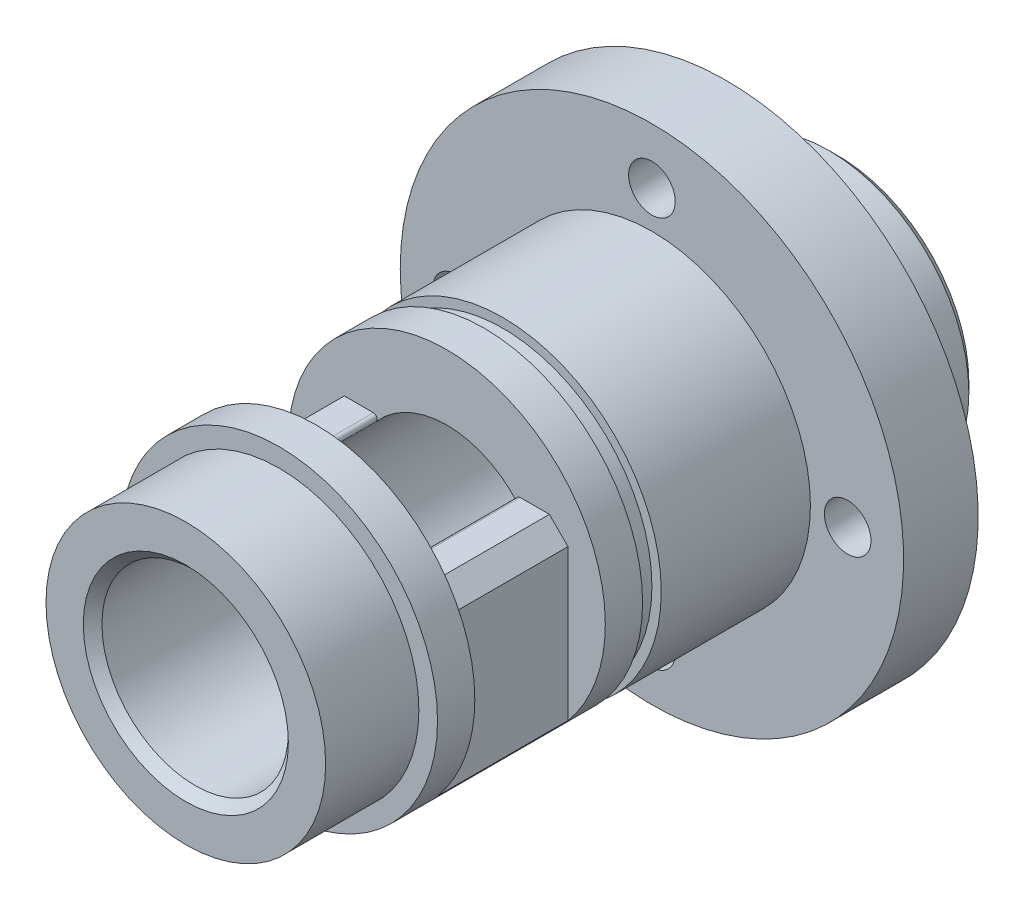
ISO-10303-21;
HEADER;
FILE_DESCRIPTION(('STEP AP214'),'2;1');
FILE_NAME('part.step','',(''),(''),'','','');
FILE_SCHEMA(('AUTOMOTIVE_DESIGN { 1 0 10303 214 1 1 1 1 }'));
ENDSEC;
DATA;
#1=APPLICATION_CONTEXT('core data for automotive mechanical design processes');
#2=APPLICATION_PROTOCOL_DEFINITION('international standard','automotive_design',2000,#1);
#3=PRODUCT_CONTEXT('',#1,'mechanical');
#4=PRODUCT('Part','Part','',(#3));
#5=PRODUCT_RELATED_PRODUCT_CATEGORY('part','',(#4));
#6=PRODUCT_DEFINITION_FORMATION('','',#4);
#7=PRODUCT_DEFINITION_CONTEXT('part definition',#1,'design');
#8=PRODUCT_DEFINITION('design','',#6,#7);
#9=PRODUCT_DEFINITION_SHAPE('','',#8);
#10=(LENGTH_UNIT() NAMED_UNIT(*) SI_UNIT(.MILLI.,.METRE.));
#11=(NAMED_UNIT(*) PLANE_ANGLE_UNIT() SI_UNIT($,.RADIAN.));
#12=(NAMED_UNIT(*) SI_UNIT($,.STERADIAN.) SOLID_ANGLE_UNIT());
#13=UNCERTAINTY_MEASURE_WITH_UNIT(LENGTH_MEASURE(1.E-05),#10,'distance_accuracy_value','');
#14=(GEOMETRIC_REPRESENTATION_CONTEXT(3) GLOBAL_UNCERTAINTY_ASSIGNED_CONTEXT((#13)) GLOBAL_UNIT_ASSIGNED_CONTEXT((#10,
#11,#12)) REPRESENTATION_CONTEXT('',''));
#15=CARTESIAN_POINT('',(0.,0.,0.));
#16=DIRECTION('',(0.,0.,1.));
#17=DIRECTION('',(1.,0.,0.));
#18=AXIS2_PLACEMENT_3D('',#15,#16,#17);
#19=CARTESIAN_POINT('',(0.,0.,20.));
#20=DIRECTION('',(0.,0.,-1.));
#21=DIRECTION('',(-1.,0.,0.));
#22=AXIS2_PLACEMENT_3D('',#19,#20,#21);
#23=CYLINDRICAL_SURFACE('',#22,8.5);
#24=CARTESIAN_POINT('',(0.,0.,11.));
#25=DIRECTION('',(0.,0.,1.));
#26=DIRECTION('',(1.,0.,0.));
#27=AXIS2_PLACEMENT_3D('',#24,#25,#26);
#28=CIRCLE('',#27,8.5);
#29=CARTESIAN_POINT('',(6.5,-5.47722557505166,11.));
#30=VERTEX_POINT('',#29);
#31=CARTESIAN_POINT('',(-6.5,-5.47722557505166,11.));
#32=VERTEX_POINT('',#31);
#33=EDGE_CURVE('E124',#30,#32,#28,.T.);
#34=ORIENTED_EDGE('',*,*,#33,.F.);
#35=DIRECTION('',(0.,0.,-1.));
#36=VECTOR('',#35,1.);
#37=CARTESIAN_POINT('',(6.5,-5.47722557505166,20.));
#38=LINE('',#37,#36);
#39=CARTESIAN_POINT('',(6.5,-5.47722557505166,18.));
#40=VERTEX_POINT('',#39);
#41=EDGE_CURVE('E127',#30,#40,#38,.F.);
#42=ORIENTED_EDGE('',*,*,#41,.T.);
#43=CARTESIAN_POINT('',(0.,0.,18.));
#44=DIRECTION('',(0.,0.,1.));
#45=DIRECTION('',(1.,0.,0.));
#46=AXIS2_PLACEMENT_3D('',#43,#44,#45);
#47=CIRCLE('',#46,8.5);
#48=CARTESIAN_POINT('',(-6.5,-5.47722557505167,18.));
#49=VERTEX_POINT('',#48);
#50=EDGE_CURVE('E177',#40,#49,#47,.T.);
#51=ORIENTED_EDGE('',*,*,#50,.T.);
#52=DIRECTION('',(0.,0.,-1.));
#53=VECTOR('',#52,1.);
#54=CARTESIAN_POINT('',(-6.5,-5.47722557505167,20.));
#55=LINE('',#54,#53);
#56=EDGE_CURVE('E129',#49,#32,#55,.T.);
#57=ORIENTED_EDGE('',*,*,#56,.T.);
#58=EDGE_LOOP('',(#34,#42,#51,#57));
#59=FACE_BOUND('',#58,.T.);
#60=CARTESIAN_POINT('',(0.,0.,9.));
#61=DIRECTION('',(0.,0.,1.));
#62=DIRECTION('',(1.,0.,0.));
#63=AXIS2_PLACEMENT_3D('',#60,#61,#62);
#64=CIRCLE('',#63,8.5);
#65=CARTESIAN_POINT('',(8.5,0.,9.));
#66=VERTEX_POINT('',#65);
#67=EDGE_CURVE('E209',#66,#66,#64,.T.);
#68=ORIENTED_EDGE('',*,*,#67,.T.);
#69=EDGE_LOOP('',(#68));
#70=FACE_BOUND('',#69,.T.);
#71=CARTESIAN_POINT('',(0.,0.,20.));
#72=DIRECTION('',(0.,0.,1.));
#73=DIRECTION('',(1.,0.,0.));
#74=AXIS2_PLACEMENT_3D('',#71,#72,#73);
#75=CIRCLE('',#74,8.5);
#76=CARTESIAN_POINT('',(8.5,0.,20.));
#77=VERTEX_POINT('',#76);
#78=EDGE_CURVE('E218',#77,#77,#75,.T.);
#79=ORIENTED_EDGE('',*,*,#78,.F.);
#80=EDGE_LOOP('',(#79));
#81=FACE_BOUND('',#80,.T.);
#82=CARTESIAN_POINT('',(0.,0.,11.));
#83=DIRECTION('',(0.,0.,1.));
#84=DIRECTION('',(1.,0.,0.));
#85=AXIS2_PLACEMENT_3D('',#82,#83,#84);
#86=CIRCLE('',#85,8.5);
#87=CARTESIAN_POINT('',(-6.02079728939615,-6.,11.));
#88=VERTEX_POINT('',#87);
#89=CARTESIAN_POINT('',(6.02079728939615,-6.,11.));
#90=VERTEX_POINT('',#89);
#91=EDGE_CURVE('E163',#88,#90,#86,.T.);
#92=ORIENTED_EDGE('',*,*,#91,.F.);
#93=DIRECTION('',(0.,0.,1.));
#94=VECTOR('',#93,1.);
#95=CARTESIAN_POINT('',(-6.02079728939615,-6.,11.));
#96=LINE('',#95,#94);
#97=CARTESIAN_POINT('',(-6.02079728939615,-6.,18.));
#98=VERTEX_POINT('',#97);
#99=EDGE_CURVE('E174',#88,#98,#96,.T.);
#100=ORIENTED_EDGE('',*,*,#99,.T.);
#101=CARTESIAN_POINT('',(0.,0.,18.));
#102=DIRECTION('',(0.,0.,1.));
#103=DIRECTION('',(1.,0.,0.));
#104=AXIS2_PLACEMENT_3D('',#101,#102,#103);
#105=CIRCLE('',#104,8.5);
#106=CARTESIAN_POINT('',(6.02079728939615,-6.,18.));
#107=VERTEX_POINT('',#106);
#108=EDGE_CURVE('E162',#98,#107,#105,.T.);
#109=ORIENTED_EDGE('',*,*,#108,.T.);
#110=DIRECTION('',(0.,0.,1.));
#111=VECTOR('',#110,1.);
#112=CARTESIAN_POINT('',(6.02079728939615,-6.,11.));
#113=LINE('',#112,#111);
#114=EDGE_CURVE('E169',#90,#107,#113,.T.);
#115=ORIENTED_EDGE('',*,*,#114,.F.);
#116=EDGE_LOOP('',(#92,#100,#109,#115));
#117=FACE_BOUND('',#116,.T.);
#118=ADVANCED_FACE('F36',(#59,#70,#81,#117),#23,.T.);
#119=CARTESIAN_POINT('',(0.,0.,25.));
#120=DIRECTION('',(0.,0.,-1.));
#121=DIRECTION('',(-1.,0.,0.));
#122=AXIS2_PLACEMENT_3D('',#119,#120,#121);
#123=CYLINDRICAL_SURFACE('',#122,5.);
#124=CARTESIAN_POINT('',(0.,0.,24.5));
#125=DIRECTION('',(0.,0.,1.));
#126=DIRECTION('',(1.,0.,0.));
#127=AXIS2_PLACEMENT_3D('',#124,#125,#126);
#128=CIRCLE('',#127,5.);
#129=CARTESIAN_POINT('',(5.,0.,24.5));
#130=VERTEX_POINT('',#129);
#131=EDGE_CURVE('E236',#130,#130,#128,.T.);
#132=ORIENTED_EDGE('',*,*,#131,.T.);
#133=EDGE_LOOP('',(#132));
#134=FACE_BOUND('',#133,.T.);
#135=CARTESIAN_POINT('',(0.,0.,-10.));
#136=DIRECTION('',(0.,0.,-1.));
#137=DIRECTION('',(-1.,0.,0.));
#138=AXIS2_PLACEMENT_3D('',#135,#136,#137);
#139=CIRCLE('',#138,5.);
#140=CARTESIAN_POINT('',(-5.,0.,-10.));
#141=VERTEX_POINT('',#140);
#142=EDGE_CURVE('E183',#141,#141,#139,.T.);
#143=ORIENTED_EDGE('',*,*,#142,.T.);
#144=EDGE_LOOP('',(#143));
#145=FACE_BOUND('',#144,.T.);
#146=DIRECTION('',(0.,0.,-1.));
#147=VECTOR('',#146,1.);
#148=CARTESIAN_POINT('',(-3.78313761017423,3.26923076923077,25.));
#149=LINE('',#148,#147);
#150=CARTESIAN_POINT('',(-3.78313761017423,3.26923076923077,11.));
#151=VERTEX_POINT('',#150);
#152=CARTESIAN_POINT('',(-3.78313761017423,3.26923076923077,18.));
#153=VERTEX_POINT('',#152);
#154=EDGE_CURVE('E260',#151,#153,#149,.F.);
#155=ORIENTED_EDGE('',*,*,#154,.T.);
#156=CARTESIAN_POINT('',(0.,0.,18.));
#157=DIRECTION('',(0.,0.,1.));
#158=DIRECTION('',(1.,0.,0.));
#159=AXIS2_PLACEMENT_3D('',#156,#157,#158);
#160=CIRCLE('',#159,5.);
#161=CARTESIAN_POINT('',(3.78313761017423,3.26923076923077,18.));
#162=VERTEX_POINT('',#161);
#163=EDGE_CURVE('E229',#153,#162,#160,.F.);
#164=ORIENTED_EDGE('',*,*,#163,.T.);
#165=DIRECTION('',(0.,0.,-1.));
#166=VECTOR('',#165,1.);
#167=CARTESIAN_POINT('',(3.78313761017423,3.26923076923077,25.));
#168=LINE('',#167,#166);
#169=CARTESIAN_POINT('',(3.78313761017423,3.26923076923077,11.));
#170=VERTEX_POINT('',#169);
#171=EDGE_CURVE('E257',#162,#170,#168,.T.);
#172=ORIENTED_EDGE('',*,*,#171,.T.);
#173=CARTESIAN_POINT('',(0.,0.,11.));
#174=DIRECTION('',(0.,0.,1.));
#175=DIRECTION('',(1.,0.,0.));
#176=AXIS2_PLACEMENT_3D('',#173,#174,#175);
#177=CIRCLE('',#176,5.);
#178=EDGE_CURVE('E231',#151,#170,#177,.F.);
#179=ORIENTED_EDGE('',*,*,#178,.F.);
#180=EDGE_LOOP('',(#155,#164,#172,#179));
#181=FACE_BOUND('',#180,.T.);
#182=ADVANCED_FACE('F278',(#134,#145,#181),#123,.F.);
#183=CARTESIAN_POINT('',(0.,0.,20.));
#184=DIRECTION('',(0.,0.,1.));
#185=DIRECTION('',(1.,0.,0.));
#186=AXIS2_PLACEMENT_3D('',#183,#184,#185);
#187=PLANE('',#186);
#188=CARTESIAN_POINT('',(0.,0.,20.));
#189=DIRECTION('',(0.,0.,1.));
#190=DIRECTION('',(1.,0.,0.));
#191=AXIS2_PLACEMENT_3D('',#188,#189,#190);
#192=CIRCLE('',#191,7.5);
#193=CARTESIAN_POINT('',(7.5,0.,20.));
#194=VERTEX_POINT('',#193);
#195=EDGE_CURVE('E212',#194,#194,#192,.T.);
#196=ORIENTED_EDGE('',*,*,#195,.F.);
#197=EDGE_LOOP('',(#196));
#198=FACE_BOUND('',#197,.T.);
#199=ORIENTED_EDGE('',*,*,#78,.T.);
#200=EDGE_LOOP('',(#199));
#201=FACE_BOUND('',#200,.T.);
#202=ADVANCED_FACE('F313',(#198,#201),#187,.T.);
#203=CARTESIAN_POINT('',(0.,0.,25.));
#204=DIRECTION('',(0.,0.,-1.));
#205=DIRECTION('',(-1.,0.,0.));
#206=AXIS2_PLACEMENT_3D('',#203,#204,#205);
#207=CYLINDRICAL_SURFACE('',#206,7.5);
#208=CARTESIAN_POINT('',(0.,0.,25.));
#209=DIRECTION('',(0.,0.,1.));
#210=DIRECTION('',(1.,0.,0.));
#211=AXIS2_PLACEMENT_3D('',#208,#209,#210);
#212=CIRCLE('',#211,7.5);
#213=CARTESIAN_POINT('',(7.5,0.,25.));
#214=VERTEX_POINT('',#213);
#215=EDGE_CURVE('E215',#214,#214,#212,.T.);
#216=ORIENTED_EDGE('',*,*,#215,.F.);
#217=EDGE_LOOP('',(#216));
#218=FACE_BOUND('',#217,.T.);
#219=ORIENTED_EDGE('',*,*,#195,.T.);
#220=EDGE_LOOP('',(#219));
#221=FACE_BOUND('',#220,.T.);
#222=ADVANCED_FACE('F351',(#218,#221),#207,.T.);
#223=CARTESIAN_POINT('',(0.,0.,25.));
#224=DIRECTION('',(0.,0.,1.));
#225=DIRECTION('',(1.,0.,0.));
#226=AXIS2_PLACEMENT_3D('',#223,#224,#225);
#227=PLANE('',#226);
#228=CARTESIAN_POINT('',(0.,0.,25.));
#229=DIRECTION('',(0.,0.,1.));
#230=DIRECTION('',(1.,0.,0.));
#231=AXIS2_PLACEMENT_3D('',#228,#229,#230);
#232=CIRCLE('',#231,5.50000000000001);
#233=CARTESIAN_POINT('',(5.50000000000001,0.,25.));
#234=VERTEX_POINT('',#233);
#235=EDGE_CURVE('E233',#234,#234,#232,.F.);
#236=ORIENTED_EDGE('',*,*,#235,.T.);
#237=EDGE_LOOP('',(#236));
#238=FACE_BOUND('',#237,.T.);
#239=ORIENTED_EDGE('',*,*,#215,.T.);
#240=EDGE_LOOP('',(#239));
#241=FACE_BOUND('',#240,.T.);
#242=ADVANCED_FACE('F345',(#238,#241),#227,.T.);
#243=CARTESIAN_POINT('',(0.,0.,9.));
#244=DIRECTION('',(0.,0.,1.));
#245=DIRECTION('',(1.,0.,0.));
#246=AXIS2_PLACEMENT_3D('',#243,#244,#245);
#247=PLANE('',#246);
#248=ORIENTED_EDGE('',*,*,#67,.F.);
#249=EDGE_LOOP('',(#248));
#250=FACE_BOUND('',#249,.T.);
#251=CARTESIAN_POINT('',(0.,0.,9.));
#252=DIRECTION('',(0.,0.,1.));
#253=DIRECTION('',(1.,0.,0.));
#254=AXIS2_PLACEMENT_3D('',#251,#252,#253);
#255=CIRCLE('',#254,8.);
#256=CARTESIAN_POINT('',(8.,0.,9.));
#257=VERTEX_POINT('',#256);
#258=EDGE_CURVE('E203',#257,#257,#255,.T.);
#259=ORIENTED_EDGE('',*,*,#258,.T.);
#260=EDGE_LOOP('',(#259));
#261=FACE_BOUND('',#260,.T.);
#262=ADVANCED_FACE('F338',(#250,#261),#247,.F.);
#263=CARTESIAN_POINT('',(0.,0.,8.));
#264=DIRECTION('',(0.,0.,1.));
#265=DIRECTION('',(1.,0.,0.));
#266=AXIS2_PLACEMENT_3D('',#263,#264,#265);
#267=PLANE('',#266);
#268=CARTESIAN_POINT('',(0.,0.,8.));
#269=DIRECTION('',(0.,0.,1.));
#270=DIRECTION('',(1.,0.,0.));
#271=AXIS2_PLACEMENT_3D('',#268,#269,#270);
#272=CIRCLE('',#271,8.5);
#273=CARTESIAN_POINT('',(8.5,0.,8.));
#274=VERTEX_POINT('',#273);
#275=EDGE_CURVE('E206',#274,#274,#272,.T.);
#276=ORIENTED_EDGE('',*,*,#275,.T.);
#277=EDGE_LOOP('',(#276));
#278=FACE_BOUND('',#277,.T.);
#279=CARTESIAN_POINT('',(0.,0.,8.));
#280=DIRECTION('',(0.,0.,1.));
#281=DIRECTION('',(1.,0.,0.));
#282=AXIS2_PLACEMENT_3D('',#279,#280,#281);
#283=CIRCLE('',#282,8.);
#284=CARTESIAN_POINT('',(8.,0.,8.));
#285=VERTEX_POINT('',#284);
#286=EDGE_CURVE('E202',#285,#285,#283,.T.);
#287=ORIENTED_EDGE('',*,*,#286,.F.);
#288=EDGE_LOOP('',(#287));
#289=FACE_BOUND('',#288,.T.);
#290=ADVANCED_FACE('F329',(#278,#289),#267,.T.);
#291=CARTESIAN_POINT('',(0.,0.,9.));
#292=DIRECTION('',(0.,0.,-1.));
#293=DIRECTION('',(-1.,0.,0.));
#294=AXIS2_PLACEMENT_3D('',#291,#292,#293);
#295=CYLINDRICAL_SURFACE('',#294,8.);
#296=ORIENTED_EDGE('',*,*,#258,.F.);
#297=EDGE_LOOP('',(#296));
#298=FACE_BOUND('',#297,.T.);
#299=ORIENTED_EDGE('',*,*,#286,.T.);
#300=EDGE_LOOP('',(#299));
#301=FACE_BOUND('',#300,.T.);
#302=ADVANCED_FACE('F320',(#298,#301),#295,.T.);
#303=CARTESIAN_POINT('',(0.,0.,0.));
#304=DIRECTION('',(0.,0.,-1.));
#305=DIRECTION('',(-1.,0.,0.));
#306=AXIS2_PLACEMENT_3D('',#303,#304,#305);
#307=CIRCLE('',#306,8.5);
#308=CARTESIAN_POINT('',(-8.5,0.,0.));
#309=VERTEX_POINT('',#308);
#310=EDGE_CURVE('E197',#309,#309,#307,.T.);
#311=ORIENTED_EDGE('',*,*,#310,.F.);
#312=EDGE_LOOP('',(#311));
#313=FACE_BOUND('',#312,.T.);
#314=ORIENTED_EDGE('',*,*,#275,.F.);
#315=EDGE_LOOP('',(#314));
#316=FACE_BOUND('',#315,.T.);
#317=ADVANCED_FACE('F309',(#313,#316),#23,.T.);
#318=CARTESIAN_POINT('',(0.,0.,-4.));
#319=DIRECTION('',(0.,0.,1.));
#320=DIRECTION('',(1.,0.,0.));
#321=AXIS2_PLACEMENT_3D('',#318,#319,#320);
#322=CYLINDRICAL_SURFACE('',#321,13.5);
#323=CARTESIAN_POINT('',(0.,0.,-4.));
#324=DIRECTION('',(0.,0.,-1.));
#325=DIRECTION('',(-1.,0.,0.));
#326=AXIS2_PLACEMENT_3D('',#323,#324,#325);
#327=CIRCLE('',#326,13.5);
#328=CARTESIAN_POINT('',(-13.5,0.,-4.));
#329=VERTEX_POINT('',#328);
#330=EDGE_CURVE('E194',#329,#329,#327,.T.);
#331=ORIENTED_EDGE('',*,*,#330,.F.);
#332=EDGE_LOOP('',(#331));
#333=FACE_BOUND('',#332,.T.);
#334=CARTESIAN_POINT('',(0.,0.,0.));
#335=DIRECTION('',(0.,0.,-1.));
#336=DIRECTION('',(-1.,0.,0.));
#337=AXIS2_PLACEMENT_3D('',#334,#335,#336);
#338=CIRCLE('',#337,13.5);
#339=CARTESIAN_POINT('',(-13.5,0.,0.));
#340=VERTEX_POINT('',#339);
#341=EDGE_CURVE('E193',#340,#340,#338,.T.);
#342=ORIENTED_EDGE('',*,*,#341,.T.);
#343=EDGE_LOOP('',(#342));
#344=FACE_BOUND('',#343,.T.);
#345=ADVANCED_FACE('F319',(#333,#344),#322,.T.);
#346=CARTESIAN_POINT('',(0.,0.,-4.));
#347=DIRECTION('',(0.,0.,-1.));
#348=DIRECTION('',(-1.,0.,0.));
#349=AXIS2_PLACEMENT_3D('',#346,#347,#348);
#350=PLANE('',#349);
#351=CARTESIAN_POINT('',(10.5,0.,-4.));
#352=DIRECTION('',(0.,0.,-1.));
#353=DIRECTION('',(-1.,0.,0.));
#354=AXIS2_PLACEMENT_3D('',#351,#352,#353);
#355=CIRCLE('',#354,1.24999999999999);
#356=CARTESIAN_POINT('',(9.25000000000001,0.,-4.));
#357=VERTEX_POINT('',#356);
#358=EDGE_CURVE('E444',#357,#357,#355,.T.);
#359=ORIENTED_EDGE('',*,*,#358,.F.);
#360=EDGE_LOOP('',(#359));
#361=FACE_BOUND('',#360,.T.);
#362=CARTESIAN_POINT('',(0.,10.5,-4.));
#363=DIRECTION('',(0.,0.,-1.));
#364=DIRECTION('',(-1.,0.,0.));
#365=AXIS2_PLACEMENT_3D('',#362,#363,#364);
#366=CIRCLE('',#365,1.24999999999999);
#367=CARTESIAN_POINT('',(-1.24999999999999,10.5,-4.));
#368=VERTEX_POINT('',#367);
#369=EDGE_CURVE('E440',#368,#368,#366,.T.);
#370=ORIENTED_EDGE('',*,*,#369,.F.);
#371=EDGE_LOOP('',(#370));
#372=FACE_BOUND('',#371,.T.);
#373=CARTESIAN_POINT('',(-10.5,0.,-4.));
#374=DIRECTION('',(0.,0.,-1.));
#375=DIRECTION('',(-1.,0.,0.));
#376=AXIS2_PLACEMENT_3D('',#373,#374,#375);
#377=CIRCLE('',#376,1.24999999999999);
#378=CARTESIAN_POINT('',(-11.75,0.,-4.));
#379=VERTEX_POINT('',#378);
#380=EDGE_CURVE('E434',#379,#379,#377,.T.);
#381=ORIENTED_EDGE('',*,*,#380,.F.);
#382=EDGE_LOOP('',(#381));
#383=FACE_BOUND('',#382,.T.);
#384=CARTESIAN_POINT('',(0.,-10.5,-4.));
#385=DIRECTION('',(0.,0.,-1.));
#386=DIRECTION('',(-1.,0.,0.));
#387=AXIS2_PLACEMENT_3D('',#384,#385,#386);
#388=CIRCLE('',#387,1.24999999999999);
#389=CARTESIAN_POINT('',(-1.24999999999999,-10.5,-4.));
#390=VERTEX_POINT('',#389);
#391=EDGE_CURVE('E154',#390,#390,#388,.T.);
#392=ORIENTED_EDGE('',*,*,#391,.F.);
#393=EDGE_LOOP('',(#392));
#394=FACE_BOUND('',#393,.T.);
#395=CARTESIAN_POINT('',(0.,0.,-4.));
#396=DIRECTION('',(0.,0.,-1.));
#397=DIRECTION('',(-1.,0.,0.));
#398=AXIS2_PLACEMENT_3D('',#395,#396,#397);
#399=CIRCLE('',#398,7.5);
#400=CARTESIAN_POINT('',(-7.5,0.,-4.));
#401=VERTEX_POINT('',#400);
#402=EDGE_CURVE('E190',#401,#401,#399,.T.);
#403=ORIENTED_EDGE('',*,*,#402,.F.);
#404=EDGE_LOOP('',(#403));
#405=FACE_BOUND('',#404,.T.);
#406=ORIENTED_EDGE('',*,*,#330,.T.);
#407=EDGE_LOOP('',(#406));
#408=FACE_BOUND('',#407,.T.);
#409=ADVANCED_FACE('F326',(#361,#372,#383,#394,#405,#408),#350,.T.);
#410=CARTESIAN_POINT('',(0.,0.,0.));
#411=DIRECTION('',(0.,0.,-1.));
#412=DIRECTION('',(-1.,0.,0.));
#413=AXIS2_PLACEMENT_3D('',#410,#411,#412);
#414=PLANE('',#413);
#415=CARTESIAN_POINT('',(10.5,0.,0.));
#416=DIRECTION('',(0.,0.,-1.));
#417=DIRECTION('',(-1.,0.,0.));
#418=AXIS2_PLACEMENT_3D('',#415,#416,#417);
#419=CIRCLE('',#418,1.24999999999999);
#420=CARTESIAN_POINT('',(9.25000000000001,0.,0.));
#421=VERTEX_POINT('',#420);
#422=EDGE_CURVE('E410',#421,#421,#419,.T.);
#423=ORIENTED_EDGE('',*,*,#422,.T.);
#424=EDGE_LOOP('',(#423));
#425=FACE_BOUND('',#424,.T.);
#426=CARTESIAN_POINT('',(0.,10.5,0.));
#427=DIRECTION('',(0.,0.,-1.));
#428=DIRECTION('',(-1.,0.,0.));
#429=AXIS2_PLACEMENT_3D('',#426,#427,#428);
#430=CIRCLE('',#429,1.24999999999999);
#431=CARTESIAN_POINT('',(-1.24999999999999,10.5,0.));
#432=VERTEX_POINT('',#431);
#433=EDGE_CURVE('E414',#432,#432,#430,.T.);
#434=ORIENTED_EDGE('',*,*,#433,.T.);
#435=EDGE_LOOP('',(#434));
#436=FACE_BOUND('',#435,.T.);
#437=CARTESIAN_POINT('',(-10.5,0.,0.));
#438=DIRECTION('',(0.,0.,-1.));
#439=DIRECTION('',(-1.,0.,0.));
#440=AXIS2_PLACEMENT_3D('',#437,#438,#439);
#441=CIRCLE('',#440,1.24999999999999);
#442=CARTESIAN_POINT('',(-11.75,0.,0.));
#443=VERTEX_POINT('',#442);
#444=EDGE_CURVE('E418',#443,#443,#441,.T.);
#445=ORIENTED_EDGE('',*,*,#444,.T.);
#446=EDGE_LOOP('',(#445));
#447=FACE_BOUND('',#446,.T.);
#448=CARTESIAN_POINT('',(0.,-10.5,0.));
#449=DIRECTION('',(0.,0.,-1.));
#450=DIRECTION('',(-1.,0.,0.));
#451=AXIS2_PLACEMENT_3D('',#448,#449,#450);
#452=CIRCLE('',#451,1.24999999999999);
#453=CARTESIAN_POINT('',(-1.24999999999999,-10.5,0.));
#454=VERTEX_POINT('',#453);
#455=EDGE_CURVE('E150',#454,#454,#452,.T.);
#456=ORIENTED_EDGE('',*,*,#455,.T.);
#457=EDGE_LOOP('',(#456));
#458=FACE_BOUND('',#457,.T.);
#459=ORIENTED_EDGE('',*,*,#310,.T.);
#460=EDGE_LOOP('',(#459));
#461=FACE_BOUND('',#460,.T.);
#462=ORIENTED_EDGE('',*,*,#341,.F.);
#463=EDGE_LOOP('',(#462));
#464=FACE_BOUND('',#463,.T.);
#465=ADVANCED_FACE('F398',(#425,#436,#447,#458,#461,#464),#414,.F.);
#466=CARTESIAN_POINT('',(0.,0.,-10.));
#467=DIRECTION('',(0.,0.,1.));
#468=DIRECTION('',(1.,0.,0.));
#469=AXIS2_PLACEMENT_3D('',#466,#467,#468);
#470=CYLINDRICAL_SURFACE('',#469,7.5);
#471=CARTESIAN_POINT('',(0.,0.,-9.50000000000001));
#472=DIRECTION('',(0.,0.,-1.));
#473=DIRECTION('',(-1.,0.,0.));
#474=AXIS2_PLACEMENT_3D('',#471,#472,#473);
#475=CIRCLE('',#474,7.5);
#476=CARTESIAN_POINT('',(-7.5,0.,-9.50000000000001));
#477=VERTEX_POINT('',#476);
#478=EDGE_CURVE('E226',#477,#477,#475,.F.);
#479=ORIENTED_EDGE('',*,*,#478,.T.);
#480=EDGE_LOOP('',(#479));
#481=FACE_BOUND('',#480,.T.);
#482=ORIENTED_EDGE('',*,*,#402,.T.);
#483=EDGE_LOOP('',(#482));
#484=FACE_BOUND('',#483,.T.);
#485=ADVANCED_FACE('F394',(#481,#484),#470,.T.);
#486=CARTESIAN_POINT('',(0.,0.,-10.));
#487=DIRECTION('',(0.,0.,-1.));
#488=DIRECTION('',(-1.,0.,0.));
#489=AXIS2_PLACEMENT_3D('',#486,#487,#488);
#490=PLANE('',#489);
#491=CARTESIAN_POINT('',(0.,0.,-10.));
#492=DIRECTION('',(0.,0.,-1.));
#493=DIRECTION('',(-1.,0.,0.));
#494=AXIS2_PLACEMENT_3D('',#491,#492,#493);
#495=CIRCLE('',#494,7.00000000000001);
#496=CARTESIAN_POINT('',(-7.00000000000001,0.,-10.));
#497=VERTEX_POINT('',#496);
#498=EDGE_CURVE('E223',#497,#497,#495,.T.);
#499=ORIENTED_EDGE('',*,*,#498,.T.);
#500=EDGE_LOOP('',(#499));
#501=FACE_BOUND('',#500,.T.);
#502=ORIENTED_EDGE('',*,*,#142,.F.);
#503=EDGE_LOOP('',(#502));
#504=FACE_BOUND('',#503,.T.);
#505=ADVANCED_FACE('F391',(#501,#504),#490,.T.);
#506=CARTESIAN_POINT('',(0.,0.,-10.));
#507=DIRECTION('',(0.,0.,1.));
#508=DIRECTION('',(1.,0.,0.));
#509=AXIS2_PLACEMENT_3D('',#506,#507,#508);
#510=CONICAL_SURFACE('',#509,7.00000000000001,0.785398163397444);
#511=ORIENTED_EDGE('',*,*,#478,.F.);
#512=EDGE_LOOP('',(#511));
#513=FACE_BOUND('',#512,.T.);
#514=ORIENTED_EDGE('',*,*,#498,.F.);
#515=EDGE_LOOP('',(#514));
#516=FACE_BOUND('',#515,.T.);
#517=ADVANCED_FACE('F389',(#513,#516),#510,.T.);
#518=CARTESIAN_POINT('',(-7.7,3.6,11.));
#519=DIRECTION('',(0.,-1.,0.));
#520=DIRECTION('',(0.,0.,-1.));
#521=AXIS2_PLACEMENT_3D('',#518,#519,#520);
#522=PLANE('',#521);
#523=DIRECTION('',(1.,0.,0.));
#524=VECTOR('',#523,1.);
#525=CARTESIAN_POINT('',(-7.7,3.6,18.));
#526=LINE('',#525,#524);
#527=CARTESIAN_POINT('',(-5.5,3.6,18.));
#528=VERTEX_POINT('',#527);
#529=CARTESIAN_POINT('',(-3.9344631145812,3.6,18.));
#530=VERTEX_POINT('',#529);
#531=EDGE_CURVE('E134',#528,#530,#526,.T.);
#532=ORIENTED_EDGE('',*,*,#531,.T.);
#533=DIRECTION('',(0.,0.,-1.));
#534=VECTOR('',#533,1.);
#535=CARTESIAN_POINT('',(-3.9344631145812,3.6,11.));
#536=LINE('',#535,#534);
#537=CARTESIAN_POINT('',(-3.9344631145812,3.6,11.));
#538=VERTEX_POINT('',#537);
#539=EDGE_CURVE('E263',#530,#538,#536,.T.);
#540=ORIENTED_EDGE('',*,*,#539,.T.);
#541=DIRECTION('',(1.,0.,0.));
#542=VECTOR('',#541,1.);
#543=CARTESIAN_POINT('',(-7.7,3.6,11.));
#544=LINE('',#543,#542);
#545=CARTESIAN_POINT('',(-5.5,3.6,11.));
#546=VERTEX_POINT('',#545);
#547=EDGE_CURVE('E180',#546,#538,#544,.T.);
#548=ORIENTED_EDGE('',*,*,#547,.F.);
#549=DIRECTION('',(0.,0.,1.));
#550=VECTOR('',#549,1.);
#551=CARTESIAN_POINT('',(-5.5,3.6,11.));
#552=LINE('',#551,#550);
#553=EDGE_CURVE('E247',#546,#528,#552,.T.);
#554=ORIENTED_EDGE('',*,*,#553,.T.);
#555=EDGE_LOOP('',(#532,#540,#548,#554));
#556=FACE_BOUND('',#555,.T.);
#557=ADVANCED_FACE('F296',(#556),#522,.F.);
#558=CARTESIAN_POINT('',(3.9344631145812,3.6,11.));
#559=VERTEX_POINT('',#558);
#560=CARTESIAN_POINT('',(5.5,3.6,11.));
#561=VERTEX_POINT('',#560);
#562=EDGE_CURVE('E133',#559,#561,#544,.T.);
#563=ORIENTED_EDGE('',*,*,#562,.F.);
#564=DIRECTION('',(0.,0.,-1.));
#565=VECTOR('',#564,1.);
#566=CARTESIAN_POINT('',(3.9344631145812,3.6,11.));
#567=LINE('',#566,#565);
#568=CARTESIAN_POINT('',(3.9344631145812,3.6,18.));
#569=VERTEX_POINT('',#568);
#570=EDGE_CURVE('E57',#559,#569,#567,.F.);
#571=ORIENTED_EDGE('',*,*,#570,.T.);
#572=CARTESIAN_POINT('',(5.5,3.6,18.));
#573=VERTEX_POINT('',#572);
#574=EDGE_CURVE('E185',#569,#573,#526,.T.);
#575=ORIENTED_EDGE('',*,*,#574,.T.);
#576=DIRECTION('',(0.,0.,-1.));
#577=VECTOR('',#576,1.);
#578=CARTESIAN_POINT('',(5.5,3.6,11.));
#579=LINE('',#578,#577);
#580=EDGE_CURVE('E241',#573,#561,#579,.T.);
#581=ORIENTED_EDGE('',*,*,#580,.T.);
#582=EDGE_LOOP('',(#563,#571,#575,#581));
#583=FACE_BOUND('',#582,.T.);
#584=ADVANCED_FACE('F286',(#583),#522,.F.);
#585=CARTESIAN_POINT('',(0.,0.,11.));
#586=DIRECTION('',(0.,0.,1.));
#587=DIRECTION('',(1.,0.,0.));
#588=AXIS2_PLACEMENT_3D('',#585,#586,#587);
#589=PLANE('',#588);
#590=ORIENTED_EDGE('',*,*,#178,.T.);
#591=CARTESIAN_POINT('',(3.9344631145812,3.4,11.));
#592=DIRECTION('',(0.,0.,1.));
#593=DIRECTION('',(1.,0.,0.));
#594=AXIS2_PLACEMENT_3D('',#591,#592,#593);
#595=CIRCLE('',#594,0.2);
#596=EDGE_CURVE('E44',#170,#559,#595,.F.);
#597=ORIENTED_EDGE('',*,*,#596,.T.);
#598=ORIENTED_EDGE('',*,*,#562,.T.);
#599=DIRECTION('',(-0.707106781186549,0.707106781186546,0.));
#600=VECTOR('',#599,1.);
#601=CARTESIAN_POINT('',(6.5,2.6,11.));
#602=LINE('',#601,#600);
#603=CARTESIAN_POINT('',(6.5,2.6,11.));
#604=VERTEX_POINT('',#603);
#605=EDGE_CURVE('E149',#561,#604,#602,.F.);
#606=ORIENTED_EDGE('',*,*,#605,.T.);
#607=DIRECTION('',(0.,1.,0.));
#608=VECTOR('',#607,1.);
#609=CARTESIAN_POINT('',(6.5,-13.5,11.));
#610=LINE('',#609,#608);
#611=EDGE_CURVE('E141',#30,#604,#610,.T.);
#612=ORIENTED_EDGE('',*,*,#611,.F.);
#613=ORIENTED_EDGE('',*,*,#33,.T.);
#614=DIRECTION('',(0.,1.,0.));
#615=VECTOR('',#614,1.);
#616=CARTESIAN_POINT('',(-6.5,-13.5,11.));
#617=LINE('',#616,#615);
#618=CARTESIAN_POINT('',(-6.5,2.6,11.));
#619=VERTEX_POINT('',#618);
#620=EDGE_CURVE('E145',#32,#619,#617,.T.);
#621=ORIENTED_EDGE('',*,*,#620,.T.);
#622=DIRECTION('',(-0.70710678118655,-0.707106781186545,0.));
#623=VECTOR('',#622,1.);
#624=CARTESIAN_POINT('',(-6.5,2.6,11.));
#625=LINE('',#624,#623);
#626=EDGE_CURVE('E253',#619,#546,#625,.F.);
#627=ORIENTED_EDGE('',*,*,#626,.T.);
#628=ORIENTED_EDGE('',*,*,#547,.T.);
#629=CARTESIAN_POINT('',(-3.9344631145812,3.4,11.));
#630=DIRECTION('',(0.,0.,1.));
#631=DIRECTION('',(1.,0.,0.));
#632=AXIS2_PLACEMENT_3D('',#629,#630,#631);
#633=CIRCLE('',#632,0.2);
#634=EDGE_CURVE('E268',#538,#151,#633,.F.);
#635=ORIENTED_EDGE('',*,*,#634,.T.);
#636=EDGE_LOOP('',(#590,#597,#598,#606,#612,#613,#621,#627,#628,#635));
#637=FACE_BOUND('',#636,.T.);
#638=ADVANCED_FACE('F147',(#637),#589,.T.);
#639=CARTESIAN_POINT('',(0.,0.,18.));
#640=DIRECTION('',(0.,0.,1.));
#641=DIRECTION('',(1.,0.,0.));
#642=AXIS2_PLACEMENT_3D('',#639,#640,#641);
#643=PLANE('',#642);
#644=ORIENTED_EDGE('',*,*,#531,.F.);
#645=DIRECTION('',(0.70710678118655,0.707106781186545,0.));
#646=VECTOR('',#645,1.);
#647=CARTESIAN_POINT('',(-4.54999999999998,4.55000000000001,18.));
#648=LINE('',#647,#646);
#649=CARTESIAN_POINT('',(-6.5,2.6,18.));
#650=VERTEX_POINT('',#649);
#651=EDGE_CURVE('E255',#528,#650,#648,.F.);
#652=ORIENTED_EDGE('',*,*,#651,.T.);
#653=DIRECTION('',(0.,1.,0.));
#654=VECTOR('',#653,1.);
#655=CARTESIAN_POINT('',(-6.5,-13.5,18.));
#656=LINE('',#655,#654);
#657=EDGE_CURVE('E157',#49,#650,#656,.T.);
#658=ORIENTED_EDGE('',*,*,#657,.F.);
#659=ORIENTED_EDGE('',*,*,#50,.F.);
#660=DIRECTION('',(0.,1.,0.));
#661=VECTOR('',#660,1.);
#662=CARTESIAN_POINT('',(6.5,-13.5,18.));
#663=LINE('',#662,#661);
#664=CARTESIAN_POINT('',(6.5,2.6,18.));
#665=VERTEX_POINT('',#664);
#666=EDGE_CURVE('E144',#40,#665,#663,.T.);
#667=ORIENTED_EDGE('',*,*,#666,.T.);
#668=DIRECTION('',(0.707106781186549,-0.707106781186546,0.));
#669=VECTOR('',#668,1.);
#670=CARTESIAN_POINT('',(4.54999999999999,4.55000000000001,18.));
#671=LINE('',#670,#669);
#672=EDGE_CURVE('E249',#665,#573,#671,.F.);
#673=ORIENTED_EDGE('',*,*,#672,.T.);
#674=ORIENTED_EDGE('',*,*,#574,.F.);
#675=CARTESIAN_POINT('',(3.9344631145812,3.4,18.));
#676=DIRECTION('',(0.,0.,1.));
#677=DIRECTION('',(1.,0.,0.));
#678=AXIS2_PLACEMENT_3D('',#675,#676,#677);
#679=CIRCLE('',#678,0.2);
#680=EDGE_CURVE('E11',#569,#162,#679,.T.);
#681=ORIENTED_EDGE('',*,*,#680,.T.);
#682=ORIENTED_EDGE('',*,*,#163,.F.);
#683=CARTESIAN_POINT('',(-3.9344631145812,3.4,18.));
#684=DIRECTION('',(0.,0.,1.));
#685=DIRECTION('',(1.,0.,0.));
#686=AXIS2_PLACEMENT_3D('',#683,#684,#685);
#687=CIRCLE('',#686,0.2);
#688=EDGE_CURVE('E266',#153,#530,#687,.T.);
#689=ORIENTED_EDGE('',*,*,#688,.T.);
#690=EDGE_LOOP('',(#644,#652,#658,#659,#667,#673,#674,#681,#682,#689));
#691=FACE_BOUND('',#690,.T.);
#692=ADVANCED_FACE('F284',(#691),#643,.F.);
#693=CARTESIAN_POINT('',(-6.02079728939615,-6.,11.));
#694=DIRECTION('',(0.,1.,0.));
#695=DIRECTION('',(0.,0.,1.));
#696=AXIS2_PLACEMENT_3D('',#693,#694,#695);
#697=PLANE('',#696);
#698=DIRECTION('',(-1.,0.,0.));
#699=VECTOR('',#698,1.);
#700=CARTESIAN_POINT('',(-6.02079728939615,-6.,18.));
#701=LINE('',#700,#699);
#702=EDGE_CURVE('E166',#107,#98,#701,.T.);
#703=ORIENTED_EDGE('',*,*,#702,.T.);
#704=ORIENTED_EDGE('',*,*,#99,.F.);
#705=DIRECTION('',(-1.,0.,0.));
#706=VECTOR('',#705,1.);
#707=CARTESIAN_POINT('',(-6.02079728939615,-6.,11.));
#708=LINE('',#707,#706);
#709=EDGE_CURVE('E165',#90,#88,#708,.T.);
#710=ORIENTED_EDGE('',*,*,#709,.F.);
#711=ORIENTED_EDGE('',*,*,#114,.T.);
#712=EDGE_LOOP('',(#703,#704,#710,#711));
#713=FACE_BOUND('',#712,.T.);
#714=ADVANCED_FACE('F370',(#713),#697,.F.);
#715=CARTESIAN_POINT('',(0.,0.,11.));
#716=DIRECTION('',(0.,0.,1.));
#717=DIRECTION('',(1.,0.,0.));
#718=AXIS2_PLACEMENT_3D('',#715,#716,#717);
#719=PLANE('',#718);
#720=ORIENTED_EDGE('',*,*,#91,.T.);
#721=ORIENTED_EDGE('',*,*,#709,.T.);
#722=EDGE_LOOP('',(#720,#721));
#723=FACE_BOUND('',#722,.T.);
#724=ADVANCED_FACE('F368',(#723),#719,.T.);
#725=CARTESIAN_POINT('',(0.,0.,18.));
#726=DIRECTION('',(0.,0.,1.));
#727=DIRECTION('',(1.,0.,0.));
#728=AXIS2_PLACEMENT_3D('',#725,#726,#727);
#729=PLANE('',#728);
#730=ORIENTED_EDGE('',*,*,#108,.F.);
#731=ORIENTED_EDGE('',*,*,#702,.F.);
#732=EDGE_LOOP('',(#730,#731));
#733=FACE_BOUND('',#732,.T.);
#734=ADVANCED_FACE('F372',(#733),#729,.F.);
#735=CARTESIAN_POINT('',(-6.5,-13.5,11.));
#736=DIRECTION('',(1.,0.,0.));
#737=DIRECTION('',(0.,0.,-1.));
#738=AXIS2_PLACEMENT_3D('',#735,#736,#737);
#739=PLANE('',#738);
#740=ORIENTED_EDGE('',*,*,#657,.T.);
#741=DIRECTION('',(0.,0.,-1.));
#742=VECTOR('',#741,1.);
#743=CARTESIAN_POINT('',(-6.5,2.6,11.));
#744=LINE('',#743,#742);
#745=EDGE_CURVE('E244',#650,#619,#744,.T.);
#746=ORIENTED_EDGE('',*,*,#745,.T.);
#747=ORIENTED_EDGE('',*,*,#620,.F.);
#748=ORIENTED_EDGE('',*,*,#56,.F.);
#749=EDGE_LOOP('',(#740,#746,#747,#748));
#750=FACE_BOUND('',#749,.T.);
#751=ADVANCED_FACE('F291',(#750),#739,.F.);
#752=CARTESIAN_POINT('',(6.5,-13.5,11.));
#753=DIRECTION('',(-1.,0.,0.));
#754=DIRECTION('',(0.,0.,1.));
#755=AXIS2_PLACEMENT_3D('',#752,#753,#754);
#756=PLANE('',#755);
#757=ORIENTED_EDGE('',*,*,#611,.T.);
#758=DIRECTION('',(0.,0.,1.));
#759=VECTOR('',#758,1.);
#760=CARTESIAN_POINT('',(6.5,2.6,11.));
#761=LINE('',#760,#759);
#762=EDGE_CURVE('E239',#604,#665,#761,.T.);
#763=ORIENTED_EDGE('',*,*,#762,.T.);
#764=ORIENTED_EDGE('',*,*,#666,.F.);
#765=ORIENTED_EDGE('',*,*,#41,.F.);
#766=EDGE_LOOP('',(#757,#763,#764,#765));
#767=FACE_BOUND('',#766,.T.);
#768=ADVANCED_FACE('F139',(#767),#756,.F.);
#769=CARTESIAN_POINT('',(0.,0.,25.));
#770=DIRECTION('',(0.,0.,1.));
#771=DIRECTION('',(1.,0.,0.));
#772=AXIS2_PLACEMENT_3D('',#769,#770,#771);
#773=CONICAL_SURFACE('',#772,5.50000000000001,0.785398163397446);
#774=ORIENTED_EDGE('',*,*,#131,.F.);
#775=EDGE_LOOP('',(#774));
#776=FACE_BOUND('',#775,.T.);
#777=ORIENTED_EDGE('',*,*,#235,.F.);
#778=EDGE_LOOP('',(#777));
#779=FACE_BOUND('',#778,.T.);
#780=ADVANCED_FACE('F305',(#776,#779),#773,.F.);
#781=CARTESIAN_POINT('',(6.5,2.6,11.));
#782=DIRECTION('',(-0.707106781186546,-0.707106781186549,0.));
#783=DIRECTION('',(0.,0.,1.));
#784=AXIS2_PLACEMENT_3D('',#781,#782,#783);
#785=PLANE('',#784);
#786=ORIENTED_EDGE('',*,*,#605,.F.);
#787=ORIENTED_EDGE('',*,*,#580,.F.);
#788=ORIENTED_EDGE('',*,*,#672,.F.);
#789=ORIENTED_EDGE('',*,*,#762,.F.);
#790=EDGE_LOOP('',(#786,#787,#788,#789));
#791=FACE_BOUND('',#790,.T.);
#792=ADVANCED_FACE('F288',(#791),#785,.F.);
#793=CARTESIAN_POINT('',(-6.5,2.6,11.));
#794=DIRECTION('',(0.707106781186545,-0.70710678118655,0.));
#795=DIRECTION('',(0.,0.,-1.));
#796=AXIS2_PLACEMENT_3D('',#793,#794,#795);
#797=PLANE('',#796);
#798=ORIENTED_EDGE('',*,*,#651,.F.);
#799=ORIENTED_EDGE('',*,*,#553,.F.);
#800=ORIENTED_EDGE('',*,*,#626,.F.);
#801=ORIENTED_EDGE('',*,*,#745,.F.);
#802=EDGE_LOOP('',(#798,#799,#800,#801));
#803=FACE_BOUND('',#802,.T.);
#804=ADVANCED_FACE('F298',(#803),#797,.F.);
#805=CARTESIAN_POINT('',(-3.9344631145812,3.4,25.));
#806=DIRECTION('',(0.,0.,-1.));
#807=DIRECTION('',(-1.,0.,0.));
#808=AXIS2_PLACEMENT_3D('',#805,#806,#807);
#809=CYLINDRICAL_SURFACE('',#808,0.2);
#810=ORIENTED_EDGE('',*,*,#634,.F.);
#811=ORIENTED_EDGE('',*,*,#539,.F.);
#812=ORIENTED_EDGE('',*,*,#688,.F.);
#813=ORIENTED_EDGE('',*,*,#154,.F.);
#814=EDGE_LOOP('',(#810,#811,#812,#813));
#815=FACE_BOUND('',#814,.T.);
#816=ADVANCED_FACE('F276',(#815),#809,.T.);
#817=CARTESIAN_POINT('',(3.9344631145812,3.4,25.));
#818=DIRECTION('',(0.,0.,-1.));
#819=DIRECTION('',(-1.,0.,0.));
#820=AXIS2_PLACEMENT_3D('',#817,#818,#819);
#821=CYLINDRICAL_SURFACE('',#820,0.2);
#822=ORIENTED_EDGE('',*,*,#680,.F.);
#823=ORIENTED_EDGE('',*,*,#570,.F.);
#824=ORIENTED_EDGE('',*,*,#596,.F.);
#825=ORIENTED_EDGE('',*,*,#171,.F.);
#826=EDGE_LOOP('',(#822,#823,#824,#825));
#827=FACE_BOUND('',#826,.T.);
#828=ADVANCED_FACE('F38',(#827),#821,.T.);
#829=CARTESIAN_POINT('',(0.,-10.5,-4.));
#830=DIRECTION('',(0.,0.,-1.));
#831=DIRECTION('',(-1.,0.,0.));
#832=AXIS2_PLACEMENT_3D('',#829,#830,#831);
#833=CYLINDRICAL_SURFACE('',#832,1.24999999999999);
#834=ORIENTED_EDGE('',*,*,#455,.F.);
#835=EDGE_LOOP('',(#834));
#836=FACE_BOUND('',#835,.T.);
#837=ORIENTED_EDGE('',*,*,#391,.T.);
#838=EDGE_LOOP('',(#837));
#839=FACE_BOUND('',#838,.T.);
#840=ADVANCED_FACE('F425',(#836,#839),#833,.F.);
#841=CARTESIAN_POINT('',(-10.5,0.,-4.));
#842=DIRECTION('',(0.,0.,-1.));
#843=DIRECTION('',(-1.,0.,0.));
#844=AXIS2_PLACEMENT_3D('',#841,#842,#843);
#845=CYLINDRICAL_SURFACE('',#844,1.24999999999999);
#846=ORIENTED_EDGE('',*,*,#444,.F.);
#847=EDGE_LOOP('',(#846));
#848=FACE_BOUND('',#847,.T.);
#849=ORIENTED_EDGE('',*,*,#380,.T.);
#850=EDGE_LOOP('',(#849));
#851=FACE_BOUND('',#850,.T.);
#852=ADVANCED_FACE('F428',(#848,#851),#845,.F.);
#853=CARTESIAN_POINT('',(0.,10.5,-4.));
#854=DIRECTION('',(0.,0.,-1.));
#855=DIRECTION('',(-1.,0.,0.));
#856=AXIS2_PLACEMENT_3D('',#853,#854,#855);
#857=CYLINDRICAL_SURFACE('',#856,1.24999999999999);
#858=ORIENTED_EDGE('',*,*,#433,.F.);
#859=EDGE_LOOP('',(#858));
#860=FACE_BOUND('',#859,.T.);
#861=ORIENTED_EDGE('',*,*,#369,.T.);
#862=EDGE_LOOP('',(#861));
#863=FACE_BOUND('',#862,.T.);
#864=ADVANCED_FACE('F460',(#860,#863),#857,.F.);
#865=CARTESIAN_POINT('',(10.5,0.,-4.));
#866=DIRECTION('',(0.,0.,-1.));
#867=DIRECTION('',(-1.,0.,0.));
#868=AXIS2_PLACEMENT_3D('',#865,#866,#867);
#869=CYLINDRICAL_SURFACE('',#868,1.24999999999999);
#870=ORIENTED_EDGE('',*,*,#422,.F.);
#871=EDGE_LOOP('',(#870));
#872=FACE_BOUND('',#871,.T.);
#873=ORIENTED_EDGE('',*,*,#358,.T.);
#874=EDGE_LOOP('',(#873));
#875=FACE_BOUND('',#874,.T.);
#876=ADVANCED_FACE('F448',(#872,#875),#869,.F.);
#877=CLOSED_SHELL('',(#118,#182,#202,#222,#242,#262,#290,#302,#317,#345,#409,#465,#485,#505,
#517,#557,#584,#638,#692,#714,#724,#734,#751,#768,#780,#792,#804,#816,#828,#840,#852,#864,#876));
#878=MANIFOLD_SOLID_BREP('B2',#877);
#879=ADVANCED_BREP_SHAPE_REPRESENTATION('',(#18,#878),#14);
#880=SHAPE_DEFINITION_REPRESENTATION(#9,#879);
ENDSEC;
END-ISO-10303-21;
